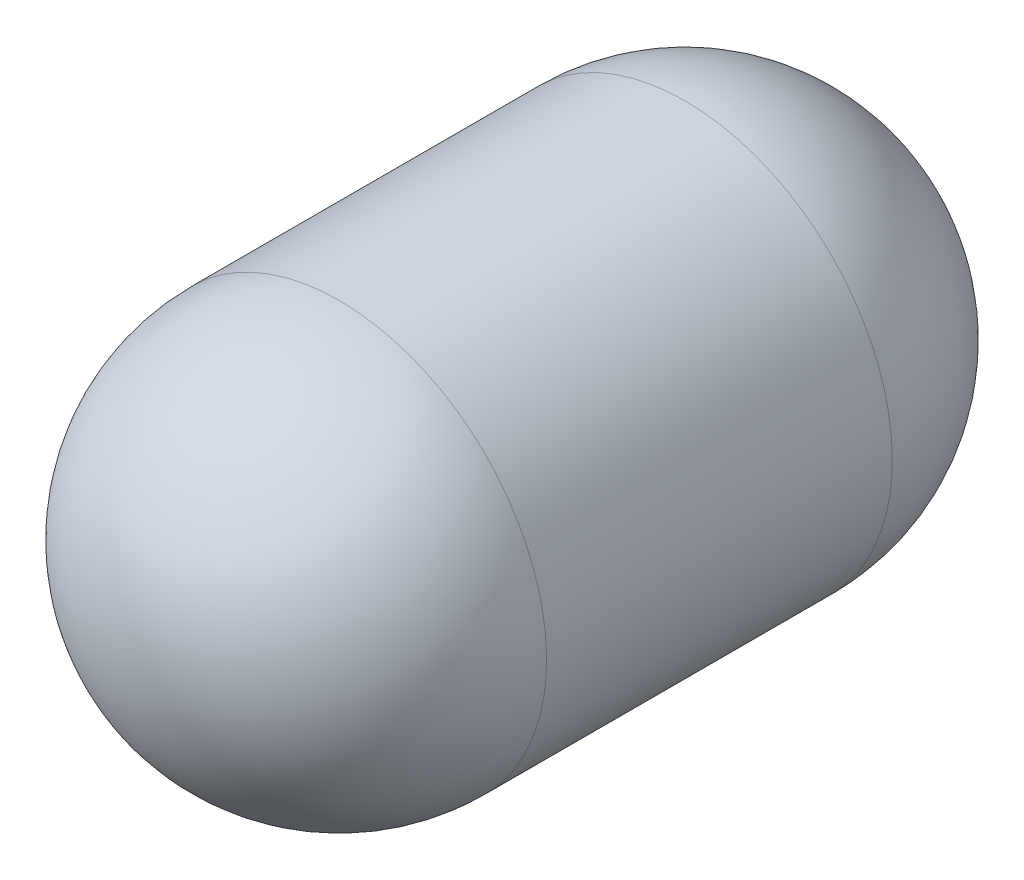
ISO-10303-21;
HEADER;
FILE_DESCRIPTION(('STEP AP214'),'2;1');
FILE_NAME('part.step','',(''),(''),'','','');
FILE_SCHEMA(('AUTOMOTIVE_DESIGN { 1 0 10303 214 1 1 1 1 }'));
ENDSEC;
DATA;
#1=APPLICATION_CONTEXT('core data for automotive mechanical design processes');
#2=APPLICATION_PROTOCOL_DEFINITION('international standard','automotive_design',2000,#1);
#3=PRODUCT_CONTEXT('',#1,'mechanical');
#4=PRODUCT('Part','Part','',(#3));
#5=PRODUCT_RELATED_PRODUCT_CATEGORY('part','',(#4));
#6=PRODUCT_DEFINITION_FORMATION('','',#4);
#7=PRODUCT_DEFINITION_CONTEXT('part definition',#1,'design');
#8=PRODUCT_DEFINITION('design','',#6,#7);
#9=PRODUCT_DEFINITION_SHAPE('','',#8);
#10=(LENGTH_UNIT() NAMED_UNIT(*) SI_UNIT(.MILLI.,.METRE.));
#11=(NAMED_UNIT(*) PLANE_ANGLE_UNIT() SI_UNIT($,.RADIAN.));
#12=(NAMED_UNIT(*) SI_UNIT($,.STERADIAN.) SOLID_ANGLE_UNIT());
#13=UNCERTAINTY_MEASURE_WITH_UNIT(LENGTH_MEASURE(1.E-05),#10,'distance_accuracy_value','');
#14=(GEOMETRIC_REPRESENTATION_CONTEXT(3) GLOBAL_UNCERTAINTY_ASSIGNED_CONTEXT((#13)) GLOBAL_UNIT_ASSIGNED_CONTEXT((#10,
#11,#12)) REPRESENTATION_CONTEXT('',''));
#15=CARTESIAN_POINT('',(0.,0.,0.));
#16=DIRECTION('',(0.,0.,1.));
#17=DIRECTION('',(1.,0.,0.));
#18=AXIS2_PLACEMENT_3D('',#15,#16,#17);
#19=CARTESIAN_POINT('',(0.,0.,-63.5));
#20=DIRECTION('',(0.,0.,-1.));
#21=DIRECTION('',(0.,1.,0.));
#22=AXIS2_PLACEMENT_3D('',#19,#20,#21);
#23=SPHERICAL_SURFACE('',#22,76.2);
#24=CARTESIAN_POINT('',(0.,0.,-63.5));
#25=DIRECTION('',(0.,0.,-1.));
#26=DIRECTION('',(0.,1.,0.));
#27=AXIS2_PLACEMENT_3D('',#24,#25,#26);
#28=CIRCLE('',#27,76.2);
#29=CARTESIAN_POINT('',(0.,76.2,-63.5));
#30=VERTEX_POINT('',#29);
#31=EDGE_CURVE('E41',#30,#30,#28,.T.);
#32=ORIENTED_EDGE('',*,*,#31,.T.);
#33=EDGE_LOOP('',(#32));
#34=FACE_BOUND('',#33,.T.);
#35=ADVANCED_FACE('F35',(#34),#23,.T.);
#36=CARTESIAN_POINT('',(0.,0.,63.5));
#37=DIRECTION('',(0.,0.,-1.));
#38=DIRECTION('',(0.,1.,0.));
#39=AXIS2_PLACEMENT_3D('',#36,#37,#38);
#40=SPHERICAL_SURFACE('',#39,76.2);
#41=CARTESIAN_POINT('',(0.,0.,63.5));
#42=DIRECTION('',(0.,0.,-1.));
#43=DIRECTION('',(0.,1.,0.));
#44=AXIS2_PLACEMENT_3D('',#41,#42,#43);
#45=CIRCLE('',#44,76.1999999999999);
#46=CARTESIAN_POINT('',(0.,76.1999999999999,63.5));
#47=VERTEX_POINT('',#46);
#48=EDGE_CURVE('E10',#47,#47,#45,.T.);
#49=ORIENTED_EDGE('',*,*,#48,.F.);
#50=EDGE_LOOP('',(#49));
#51=FACE_BOUND('',#50,.T.);
#52=ADVANCED_FACE('F50',(#51),#40,.T.);
#53=CARTESIAN_POINT('',(0.,0.,-139.7));
#54=DIRECTION('',(0.,0.,-1.));
#55=DIRECTION('',(0.,1.,0.));
#56=AXIS2_PLACEMENT_3D('',#53,#54,#55);
#57=CYLINDRICAL_SURFACE('',#56,76.2);
#58=ORIENTED_EDGE('',*,*,#48,.T.);
#59=EDGE_LOOP('',(#58));
#60=FACE_BOUND('',#59,.T.);
#61=ORIENTED_EDGE('',*,*,#31,.F.);
#62=EDGE_LOOP('',(#61));
#63=FACE_BOUND('',#62,.T.);
#64=ADVANCED_FACE('F48',(#60,#63),#57,.T.);
#65=CLOSED_SHELL('',(#35,#52,#64));
#66=MANIFOLD_SOLID_BREP('B2',#65);
#67=ADVANCED_BREP_SHAPE_REPRESENTATION('',(#18,#66),#14);
#68=SHAPE_DEFINITION_REPRESENTATION(#9,#67);
ENDSEC;
END-ISO-10303-21;
